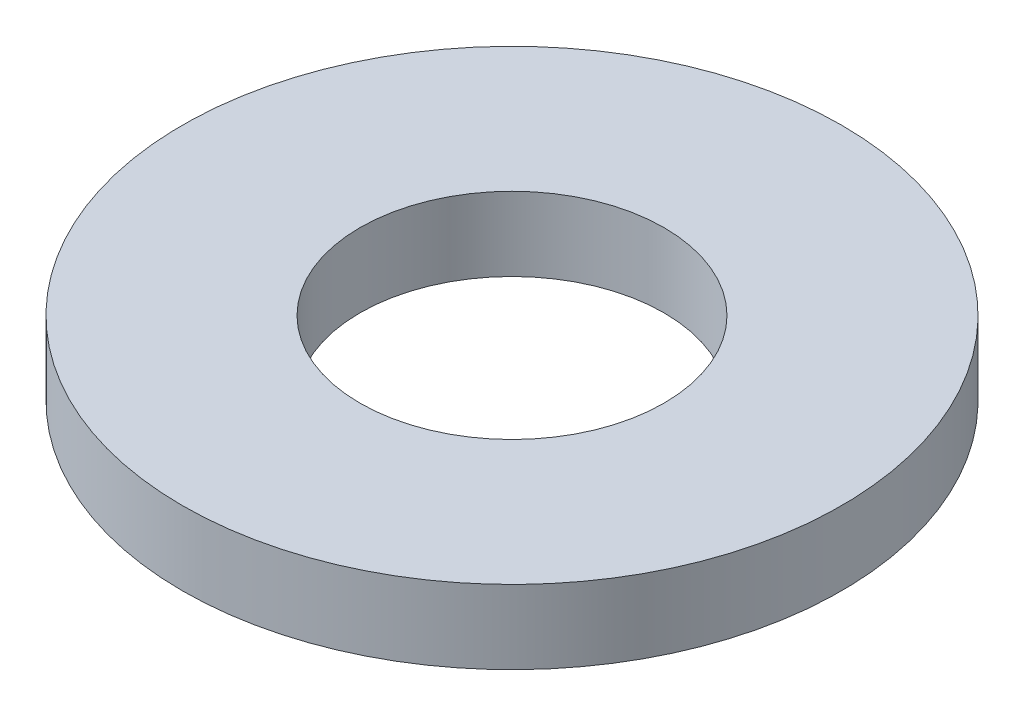
ISO-10303-21;
HEADER;
FILE_DESCRIPTION(('STEP AP214'),'2;1');
FILE_NAME('part.step','',(''),(''),'','','');
FILE_SCHEMA(('AUTOMOTIVE_DESIGN { 1 0 10303 214 1 1 1 1 }'));
ENDSEC;
DATA;
#1=APPLICATION_CONTEXT('core data for automotive mechanical design processes');
#2=APPLICATION_PROTOCOL_DEFINITION('international standard','automotive_design',2000,#1);
#3=PRODUCT_CONTEXT('',#1,'mechanical');
#4=PRODUCT('Part','Part','',(#3));
#5=PRODUCT_RELATED_PRODUCT_CATEGORY('part','',(#4));
#6=PRODUCT_DEFINITION_FORMATION('','',#4);
#7=PRODUCT_DEFINITION_CONTEXT('part definition',#1,'design');
#8=PRODUCT_DEFINITION('design','',#6,#7);
#9=PRODUCT_DEFINITION_SHAPE('','',#8);
#10=(LENGTH_UNIT() NAMED_UNIT(*) SI_UNIT(.MILLI.,.METRE.));
#11=(NAMED_UNIT(*) PLANE_ANGLE_UNIT() SI_UNIT($,.RADIAN.));
#12=(NAMED_UNIT(*) SI_UNIT($,.STERADIAN.) SOLID_ANGLE_UNIT());
#13=UNCERTAINTY_MEASURE_WITH_UNIT(LENGTH_MEASURE(1.E-05),#10,'distance_accuracy_value','');
#14=(GEOMETRIC_REPRESENTATION_CONTEXT(3) GLOBAL_UNCERTAINTY_ASSIGNED_CONTEXT((#13)) GLOBAL_UNIT_ASSIGNED_CONTEXT((#10,
#11,#12)) REPRESENTATION_CONTEXT('',''));
#15=CARTESIAN_POINT('',(0.,0.,0.));
#16=DIRECTION('',(0.,0.,1.));
#17=DIRECTION('',(1.,0.,0.));
#18=AXIS2_PLACEMENT_3D('',#15,#16,#17);
#19=CARTESIAN_POINT('',(0.,0.,0.));
#20=DIRECTION('',(0.,1.,0.));
#21=DIRECTION('',(0.,0.,-1.));
#22=AXIS2_PLACEMENT_3D('',#19,#20,#21);
#23=PLANE('',#22);
#24=CARTESIAN_POINT('',(0.,0.,0.));
#25=DIRECTION('',(0.,1.,0.));
#26=DIRECTION('',(0.,0.,1.));
#27=AXIS2_PLACEMENT_3D('',#24,#25,#26);
#28=CIRCLE('',#27,2.1971);
#29=CARTESIAN_POINT('',(0.,0.,2.1971));
#30=VERTEX_POINT('',#29);
#31=EDGE_CURVE('E44',#30,#30,#28,.F.);
#32=ORIENTED_EDGE('',*,*,#31,.F.);
#33=EDGE_LOOP('',(#32));
#34=FACE_BOUND('',#33,.T.);
#35=CARTESIAN_POINT('',(0.,0.,0.));
#36=DIRECTION('',(0.,1.,0.));
#37=DIRECTION('',(0.,0.,1.));
#38=AXIS2_PLACEMENT_3D('',#35,#36,#37);
#39=CIRCLE('',#38,4.7625);
#40=CARTESIAN_POINT('',(0.,0.,4.7625));
#41=VERTEX_POINT('',#40);
#42=EDGE_CURVE('E35',#41,#41,#39,.F.);
#43=ORIENTED_EDGE('',*,*,#42,.T.);
#44=EDGE_LOOP('',(#43));
#45=FACE_BOUND('',#44,.T.);
#46=ADVANCED_FACE('F32',(#34,#45),#23,.F.);
#47=CARTESIAN_POINT('',(0.,1.0668,0.));
#48=DIRECTION('',(0.,-1.,0.));
#49=DIRECTION('',(0.,0.,1.));
#50=AXIS2_PLACEMENT_3D('',#47,#48,#49);
#51=CYLINDRICAL_SURFACE('',#50,4.7625);
#52=ORIENTED_EDGE('',*,*,#42,.F.);
#53=EDGE_LOOP('',(#52));
#54=FACE_BOUND('',#53,.T.);
#55=CARTESIAN_POINT('',(0.,1.0668,0.));
#56=DIRECTION('',(0.,1.,0.));
#57=DIRECTION('',(0.,0.,1.));
#58=AXIS2_PLACEMENT_3D('',#55,#56,#57);
#59=CIRCLE('',#58,4.7625);
#60=CARTESIAN_POINT('',(0.,1.0668,4.7625));
#61=VERTEX_POINT('',#60);
#62=EDGE_CURVE('E39',#61,#61,#59,.F.);
#63=ORIENTED_EDGE('',*,*,#62,.T.);
#64=EDGE_LOOP('',(#63));
#65=FACE_BOUND('',#64,.T.);
#66=ADVANCED_FACE('F53',(#54,#65),#51,.T.);
#67=CARTESIAN_POINT('',(0.,1.0668,0.));
#68=DIRECTION('',(0.,-1.,0.));
#69=DIRECTION('',(0.,0.,1.));
#70=AXIS2_PLACEMENT_3D('',#67,#68,#69);
#71=CYLINDRICAL_SURFACE('',#70,2.1971);
#72=CARTESIAN_POINT('',(0.,1.0668,0.));
#73=DIRECTION('',(0.,1.,0.));
#74=DIRECTION('',(0.,0.,1.));
#75=AXIS2_PLACEMENT_3D('',#72,#73,#74);
#76=CIRCLE('',#75,2.1971);
#77=CARTESIAN_POINT('',(0.,1.0668,2.1971));
#78=VERTEX_POINT('',#77);
#79=EDGE_CURVE('E10',#78,#78,#76,.T.);
#80=ORIENTED_EDGE('',*,*,#79,.T.);
#81=EDGE_LOOP('',(#80));
#82=FACE_BOUND('',#81,.T.);
#83=ORIENTED_EDGE('',*,*,#31,.T.);
#84=EDGE_LOOP('',(#83));
#85=FACE_BOUND('',#84,.T.);
#86=ADVANCED_FACE('F56',(#82,#85),#71,.F.);
#87=CARTESIAN_POINT('',(0.,1.0668,0.));
#88=DIRECTION('',(0.,1.,0.));
#89=DIRECTION('',(0.,0.,-1.));
#90=AXIS2_PLACEMENT_3D('',#87,#88,#89);
#91=PLANE('',#90);
#92=ORIENTED_EDGE('',*,*,#79,.F.);
#93=EDGE_LOOP('',(#92));
#94=FACE_BOUND('',#93,.T.);
#95=ORIENTED_EDGE('',*,*,#62,.F.);
#96=EDGE_LOOP('',(#95));
#97=FACE_BOUND('',#96,.T.);
#98=ADVANCED_FACE('F59',(#94,#97),#91,.T.);
#99=CLOSED_SHELL('',(#46,#66,#86,#98));
#100=MANIFOLD_SOLID_BREP('B2',#99);
#101=ADVANCED_BREP_SHAPE_REPRESENTATION('',(#18,#100),#14);
#102=SHAPE_DEFINITION_REPRESENTATION(#9,#101);
ENDSEC;
END-ISO-10303-21;
